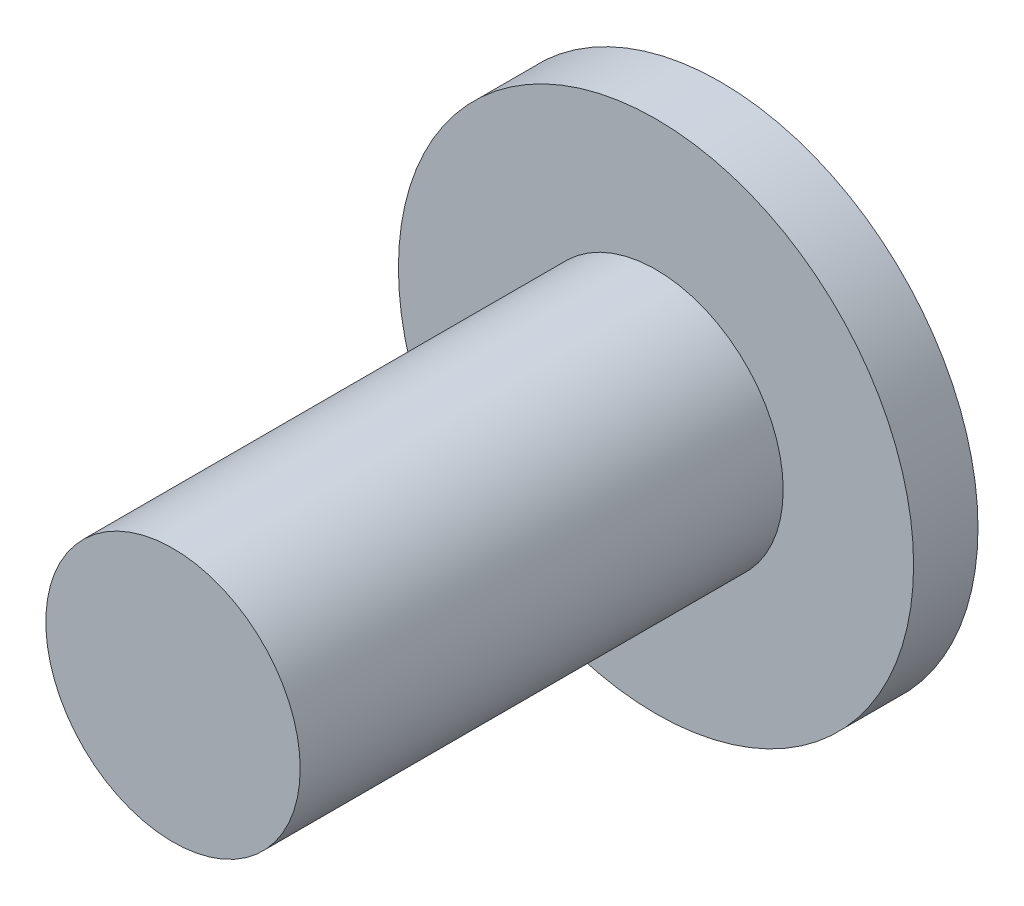
ISO-10303-21;
HEADER;
FILE_DESCRIPTION(('STEP AP214'),'2;1');
FILE_NAME('part.step','',(''),(''),'','','');
FILE_SCHEMA(('AUTOMOTIVE_DESIGN { 1 0 10303 214 1 1 1 1 }'));
ENDSEC;
DATA;
#1=APPLICATION_CONTEXT('core data for automotive mechanical design processes');
#2=APPLICATION_PROTOCOL_DEFINITION('international standard','automotive_design',2000,#1);
#3=PRODUCT_CONTEXT('',#1,'mechanical');
#4=PRODUCT('Part','Part','',(#3));
#5=PRODUCT_RELATED_PRODUCT_CATEGORY('part','',(#4));
#6=PRODUCT_DEFINITION_FORMATION('','',#4);
#7=PRODUCT_DEFINITION_CONTEXT('part definition',#1,'design');
#8=PRODUCT_DEFINITION('design','',#6,#7);
#9=PRODUCT_DEFINITION_SHAPE('','',#8);
#10=(LENGTH_UNIT() NAMED_UNIT(*) SI_UNIT(.MILLI.,.METRE.));
#11=(NAMED_UNIT(*) PLANE_ANGLE_UNIT() SI_UNIT($,.RADIAN.));
#12=(NAMED_UNIT(*) SI_UNIT($,.STERADIAN.) SOLID_ANGLE_UNIT());
#13=UNCERTAINTY_MEASURE_WITH_UNIT(LENGTH_MEASURE(1.E-05),#10,'distance_accuracy_value','');
#14=(GEOMETRIC_REPRESENTATION_CONTEXT(3) GLOBAL_UNCERTAINTY_ASSIGNED_CONTEXT((#13)) GLOBAL_UNIT_ASSIGNED_CONTEXT((#10,
#11,#12)) REPRESENTATION_CONTEXT('',''));
#15=CARTESIAN_POINT('',(0.,0.,0.));
#16=DIRECTION('',(0.,0.,1.));
#17=DIRECTION('',(1.,0.,0.));
#18=AXIS2_PLACEMENT_3D('',#15,#16,#17);
#19=CARTESIAN_POINT('',(0.,0.,0.));
#20=DIRECTION('',(0.,0.,-1.));
#21=DIRECTION('',(-1.,0.,0.));
#22=AXIS2_PLACEMENT_3D('',#19,#20,#21);
#23=PLANE('',#22);
#24=CARTESIAN_POINT('',(0.,0.,0.));
#25=DIRECTION('',(0.,0.,1.));
#26=DIRECTION('',(1.,0.,0.));
#27=AXIS2_PLACEMENT_3D('',#24,#25,#26);
#28=CIRCLE('',#27,3.95);
#29=CARTESIAN_POINT('',(3.95,0.,0.));
#30=VERTEX_POINT('',#29);
#31=EDGE_CURVE('E10',#30,#30,#28,.T.);
#32=ORIENTED_EDGE('',*,*,#31,.T.);
#33=EDGE_LOOP('',(#32));
#34=FACE_BOUND('',#33,.T.);
#35=ADVANCED_FACE('F45',(#34),#23,.F.);
#36=CARTESIAN_POINT('',(0.,0.,0.));
#37=DIRECTION('',(0.,0.,1.));
#38=DIRECTION('',(1.,0.,0.));
#39=AXIS2_PLACEMENT_3D('',#36,#37,#38);
#40=CYLINDRICAL_SURFACE('',#39,3.95);
#41=ORIENTED_EDGE('',*,*,#31,.F.);
#42=EDGE_LOOP('',(#41));
#43=FACE_BOUND('',#42,.T.);
#44=CARTESIAN_POINT('',(0.,0.,-15.));
#45=DIRECTION('',(0.,0.,1.));
#46=DIRECTION('',(1.,0.,0.));
#47=AXIS2_PLACEMENT_3D('',#44,#45,#46);
#48=CIRCLE('',#47,3.95);
#49=CARTESIAN_POINT('',(3.95,0.,-15.));
#50=VERTEX_POINT('',#49);
#51=EDGE_CURVE('E52',#50,#50,#48,.T.);
#52=ORIENTED_EDGE('',*,*,#51,.T.);
#53=EDGE_LOOP('',(#52));
#54=FACE_BOUND('',#53,.T.);
#55=ADVANCED_FACE('F81',(#43,#54),#40,.T.);
#56=CARTESIAN_POINT('',(0.,0.,-15.));
#57=DIRECTION('',(0.,0.,-1.));
#58=DIRECTION('',(-1.,0.,0.));
#59=AXIS2_PLACEMENT_3D('',#56,#57,#58);
#60=PLANE('',#59);
#61=ORIENTED_EDGE('',*,*,#51,.F.);
#62=EDGE_LOOP('',(#61));
#63=FACE_BOUND('',#62,.T.);
#64=CARTESIAN_POINT('',(0.,0.,-15.));
#65=DIRECTION('',(0.,0.,1.));
#66=DIRECTION('',(1.,0.,0.));
#67=AXIS2_PLACEMENT_3D('',#64,#65,#66);
#68=CIRCLE('',#67,8.);
#69=CARTESIAN_POINT('',(8.,0.,-15.));
#70=VERTEX_POINT('',#69);
#71=EDGE_CURVE('E57',#70,#70,#68,.T.);
#72=ORIENTED_EDGE('',*,*,#71,.T.);
#73=EDGE_LOOP('',(#72));
#74=FACE_BOUND('',#73,.T.);
#75=ADVANCED_FACE('F77',(#63,#74),#60,.F.);
#76=CARTESIAN_POINT('',(0.,0.,0.));
#77=DIRECTION('',(0.,0.,1.));
#78=DIRECTION('',(1.,0.,0.));
#79=AXIS2_PLACEMENT_3D('',#76,#77,#78);
#80=CYLINDRICAL_SURFACE('',#79,8.);
#81=ORIENTED_EDGE('',*,*,#71,.F.);
#82=EDGE_LOOP('',(#81));
#83=FACE_BOUND('',#82,.T.);
#84=CARTESIAN_POINT('',(0.,0.,-17.));
#85=DIRECTION('',(0.,0.,1.));
#86=DIRECTION('',(1.,0.,0.));
#87=AXIS2_PLACEMENT_3D('',#84,#85,#86);
#88=CIRCLE('',#87,8.);
#89=CARTESIAN_POINT('',(8.,0.,-17.));
#90=VERTEX_POINT('',#89);
#91=EDGE_CURVE('E62',#90,#90,#88,.T.);
#92=ORIENTED_EDGE('',*,*,#91,.T.);
#93=EDGE_LOOP('',(#92));
#94=FACE_BOUND('',#93,.T.);
#95=ADVANCED_FACE('F69',(#83,#94),#80,.T.);
#96=CARTESIAN_POINT('',(0.,0.,-17.));
#97=DIRECTION('',(0.,0.,1.));
#98=DIRECTION('',(1.,0.,0.));
#99=AXIS2_PLACEMENT_3D('',#96,#97,#98);
#100=PLANE('',#99);
#101=ORIENTED_EDGE('',*,*,#91,.F.);
#102=EDGE_LOOP('',(#101));
#103=FACE_BOUND('',#102,.T.);
#104=ADVANCED_FACE('F71',(#103),#100,.F.);
#105=CLOSED_SHELL('',(#35,#55,#75,#95,#104));
#106=MANIFOLD_SOLID_BREP('B2',#105);
#107=ADVANCED_BREP_SHAPE_REPRESENTATION('',(#18,#106),#14);
#108=SHAPE_DEFINITION_REPRESENTATION(#9,#107);
ENDSEC;
END-ISO-10303-21;
